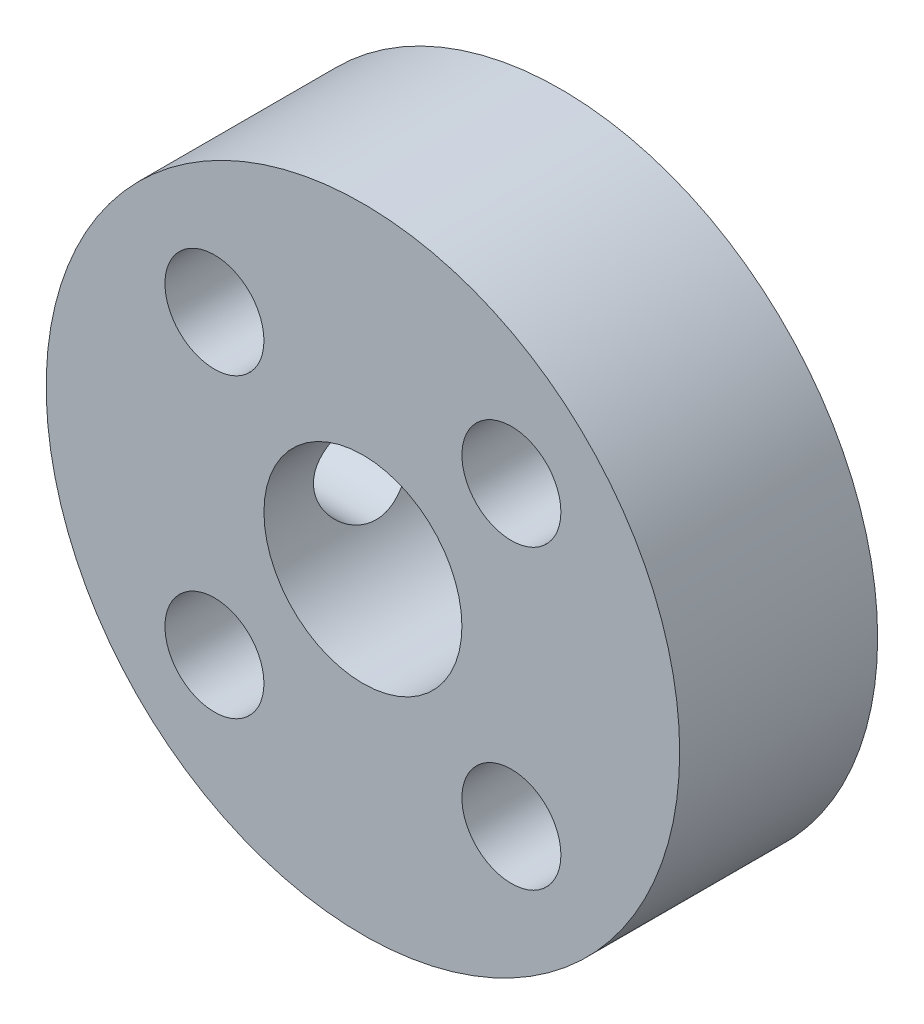
ISO-10303-21;
HEADER;
FILE_DESCRIPTION(('STEP AP214'),'2;1');
FILE_NAME('part.step','',(''),(''),'','','');
FILE_SCHEMA(('AUTOMOTIVE_DESIGN { 1 0 10303 214 1 1 1 1 }'));
ENDSEC;
DATA;
#1=APPLICATION_CONTEXT('core data for automotive mechanical design processes');
#2=APPLICATION_PROTOCOL_DEFINITION('international standard','automotive_design',2000,#1);
#3=PRODUCT_CONTEXT('',#1,'mechanical');
#4=PRODUCT('Part','Part','',(#3));
#5=PRODUCT_RELATED_PRODUCT_CATEGORY('part','',(#4));
#6=PRODUCT_DEFINITION_FORMATION('','',#4);
#7=PRODUCT_DEFINITION_CONTEXT('part definition',#1,'design');
#8=PRODUCT_DEFINITION('design','',#6,#7);
#9=PRODUCT_DEFINITION_SHAPE('','',#8);
#10=(LENGTH_UNIT() NAMED_UNIT(*) SI_UNIT(.MILLI.,.METRE.));
#11=(NAMED_UNIT(*) PLANE_ANGLE_UNIT() SI_UNIT($,.RADIAN.));
#12=(NAMED_UNIT(*) SI_UNIT($,.STERADIAN.) SOLID_ANGLE_UNIT());
#13=UNCERTAINTY_MEASURE_WITH_UNIT(LENGTH_MEASURE(1.E-05),#10,'distance_accuracy_value','');
#14=(GEOMETRIC_REPRESENTATION_CONTEXT(3) GLOBAL_UNCERTAINTY_ASSIGNED_CONTEXT((#13)) GLOBAL_UNIT_ASSIGNED_CONTEXT((#10,
#11,#12)) REPRESENTATION_CONTEXT('',''));
#15=CARTESIAN_POINT('',(0.,0.,0.));
#16=DIRECTION('',(0.,0.,1.));
#17=DIRECTION('',(1.,0.,0.));
#18=AXIS2_PLACEMENT_3D('',#15,#16,#17);
#19=CARTESIAN_POINT('',(0.,0.,12.7));
#20=DIRECTION('',(0.,0.,-1.));
#21=DIRECTION('',(-1.,0.,0.));
#22=AXIS2_PLACEMENT_3D('',#19,#20,#21);
#23=CYLINDRICAL_SURFACE('',#22,6.35);
#24=CARTESIAN_POINT('',(-6.35,0.,9.525));
#25=CARTESIAN_POINT('',(-6.34999931166444,-0.0834969220594998,9.52499911228237));
#26=CARTESIAN_POINT('',(-6.34834758911701,-0.167002655580042,9.52170012555405));
#27=CARTESIAN_POINT('',(-6.34179105821714,-0.333378330258781,9.50855412545011));
#28=CARTESIAN_POINT('',(-6.33688483467113,-0.416247978955771,9.49870426347423));
#29=CARTESIAN_POINT('',(-6.31742426748325,-0.663182030647009,9.45942793495399));
#30=CARTESIAN_POINT('',(-6.29812827299425,-0.825450146761554,9.4202749225986));
#31=CARTESIAN_POINT('',(-6.2489182313574,-1.13965128900426,9.31800928870585));
#32=CARTESIAN_POINT('',(-6.21904547786825,-1.29162180811868,9.25498978075659));
#33=CARTESIAN_POINT('',(-6.15142812041637,-1.58264035037879,9.1072639263711));
#34=CARTESIAN_POINT('',(-6.11368413715877,-1.72168939123018,9.02255928984904));
#35=CARTESIAN_POINT('',(-6.03111096182982,-1.99234108848171,8.82803037026578));
#36=CARTESIAN_POINT('',(-5.98599127270818,-2.12298433900091,8.71699642220607));
#37=CARTESIAN_POINT('',(-5.89470535591056,-2.36467069069853,8.47560331642721));
#38=CARTESIAN_POINT('',(-5.84853836069043,-2.47569885601321,8.34522957023356));
#39=CARTESIAN_POINT('',(-5.75623634934464,-2.68368848497886,8.05657905224669));
#40=CARTESIAN_POINT('',(-5.71038146176788,-2.77889135161934,7.89692246869841));
#41=CARTESIAN_POINT('',(-5.64919759286363,-2.90019349951534,7.64545201282557));
#42=CARTESIAN_POINT('',(-5.63006420805933,-2.93705266116892,7.55959993817132));
#43=CARTESIAN_POINT('',(-5.59504604853267,-3.00322508739606,7.38441438629358));
#44=CARTESIAN_POINT('',(-5.57915935583429,-3.03254280972159,7.29508300181945));
#45=CARTESIAN_POINT('',(-5.55212611635049,-3.08174263292982,7.11898944803526));
#46=CARTESIAN_POINT('',(-5.54075429137746,-3.10208128111978,7.03238920597143));
#47=CARTESIAN_POINT('',(-5.52193654886444,-3.13545600360765,6.8574127210056));
#48=CARTESIAN_POINT('',(-5.51448854851135,-3.14849595237257,6.7690374462283));
#49=CARTESIAN_POINT('',(-5.50383875782919,-3.1670771305344,6.59129326115138));
#50=CARTESIAN_POINT('',(-5.50063441026522,-3.1726228759965,6.5019249820126));
#51=CARTESIAN_POINT('',(-5.49859788398609,-3.17614778806993,6.32301921582192));
#52=CARTESIAN_POINT('',(-5.49976528812799,-3.17412767659872,6.23348174572866));
#53=CARTESIAN_POINT('',(-5.50899190362732,-3.1581193033026,5.98725212427559));
#54=CARTESIAN_POINT('',(-5.52160857357707,-3.13621253452965,5.83115827018664));
#55=CARTESIAN_POINT('',(-5.55866493052824,-3.07003746372168,5.52535335869347));
#56=CARTESIAN_POINT('',(-5.58310838358077,-3.02576203854504,5.37564435097724));
#57=CARTESIAN_POINT('',(-5.64157885407236,-2.91531509833647,5.08245570343586));
#58=CARTESIAN_POINT('',(-5.67581583876129,-2.84865758129418,4.93920239006338));
#59=CARTESIAN_POINT('',(-5.75003268807633,-2.69570761526054,4.66523391382598));
#60=CARTESIAN_POINT('',(-5.79001512927804,-2.60940634674629,4.53452442039149));
#61=CARTESIAN_POINT('',(-5.87734289018611,-2.40685964249565,4.27189572574971));
#62=CARTESIAN_POINT('',(-5.92497898403936,-2.28820488335253,4.14192461514349));
#63=CARTESIAN_POINT('',(-6.01813700574905,-2.03058898448427,3.90291485713616));
#64=CARTESIAN_POINT('',(-6.06365791538158,-1.89161819563546,3.7938862136413));
#65=CARTESIAN_POINT('',(-6.1500381059768,-1.58913989972483,3.59509808028028));
#66=CARTESIAN_POINT('',(-6.19058274974572,-1.42479265164789,3.50646851442006));
#67=CARTESIAN_POINT('',(-6.25976272299952,-1.08098023585583,3.35884191836465));
#68=CARTESIAN_POINT('',(-6.28840750578946,-0.901527205073897,3.29982135886829));
#69=CARTESIAN_POINT('',(-6.32854759690358,-0.548533610626835,3.21794059660095));
#70=CARTESIAN_POINT('',(-6.34126679122995,-0.375734359385246,3.19249032741266));
#71=CARTESIAN_POINT('',(-6.35231817716325,-0.0278752299448331,3.17034947773974));
#72=CARTESIAN_POINT('',(-6.35065718436129,0.147183538060018,3.17364527286068));
#73=CARTESIAN_POINT('',(-6.33384535408399,0.480164686080361,3.20740623594539));
#74=CARTESIAN_POINT('',(-6.31975005060431,0.638363620564189,3.23574579147484));
#75=CARTESIAN_POINT('',(-6.28085393924121,0.947441883053,3.31545587820989));
#76=CARTESIAN_POINT('',(-6.25605195113515,1.09832040207141,3.36682894847728));
#77=CARTESIAN_POINT('',(-6.19709998236334,1.39347133182512,3.4924951309378));
#78=CARTESIAN_POINT('',(-6.16270299610718,1.53743151047822,3.56740158411119));
#79=CARTESIAN_POINT('',(-6.08787118465664,1.8112148234104,3.73731642568587));
#80=CARTESIAN_POINT('',(-6.0474337895468,1.94103189959927,3.8323333773854));
#81=CARTESIAN_POINT('',(-5.95973602709939,2.19636241342679,4.05053935037377));
#82=CARTESIAN_POINT('',(-5.91219559251098,2.3202013468198,4.17557860711157));
#83=CARTESIAN_POINT('',(-5.81858093231368,2.54589381918874,4.44476235514975));
#84=CARTESIAN_POINT('',(-5.77250773963547,2.6477321493525,4.58891995238093));
#85=CARTESIAN_POINT('',(-5.68487535288742,2.83117262876716,4.90106860195835));
#86=CARTESIAN_POINT('',(-5.64364281441821,2.91155594998014,5.06987576951038));
#87=CARTESIAN_POINT('',(-5.5744767953732,3.04191297152938,5.42134446488967));
#88=CARTESIAN_POINT('',(-5.54652618900869,3.0919258549222,5.60398779784738));
#89=CARTESIAN_POINT('',(-5.51057765714603,3.15551086037918,5.95918995647016));
#90=CARTESIAN_POINT('',(-5.50092192343245,3.17212027309711,6.13103375040721));
#91=CARTESIAN_POINT('',(-5.49800001145358,3.17718805563876,6.4752444424952));
#92=CARTESIAN_POINT('',(-5.5047267290444,3.16565862768386,6.64761108154264));
#93=CARTESIAN_POINT('',(-5.53205211477784,3.11761548073658,6.97066010307391));
#94=CARTESIAN_POINT('',(-5.55126823076269,3.08358651207686,7.12184394173115));
#95=CARTESIAN_POINT('',(-5.59977978302582,2.99458164828807,7.41619083016717));
#96=CARTESIAN_POINT('',(-5.62907846127335,2.93959901505999,7.5593512828503));
#97=CARTESIAN_POINT('',(-5.69685576337174,2.8061154442137,7.84423369942855));
#98=CARTESIAN_POINT('',(-5.73581889480533,2.72628260503929,7.98521280936567));
#99=CARTESIAN_POINT('',(-5.81772207082382,2.54682759156583,8.2526974317231));
#100=CARTESIAN_POINT('',(-5.8606641782013,2.44719512169931,8.3791953599427));
#101=CARTESIAN_POINT('',(-5.95192753761203,2.21680287661219,8.63009752417706));
#102=CARTESIAN_POINT('',(-6.00026839877346,2.08373188558713,8.75237975641279));
#103=CARTESIAN_POINT('',(-6.0921234557675,1.79751265125244,8.97339787323311));
#104=CARTESIAN_POINT('',(-6.13563504323042,1.64435365457428,9.07212106598272));
#105=CARTESIAN_POINT('',(-6.19391073190243,1.40178715704487,9.20028026619707));
#106=CARTESIAN_POINT('',(-6.21223173271383,1.31842200030919,9.23980058368139));
#107=CARTESIAN_POINT('',(-6.24595363475604,1.14807701021671,9.31159947482369));
#108=CARTESIAN_POINT('',(-6.26135597012704,1.06109897786306,9.34388160653437));
#109=CARTESIAN_POINT('',(-6.28875097111981,0.884361322813108,9.400759345915));
#110=CARTESIAN_POINT('',(-6.30075106809478,0.794608244970572,9.42537171813811));
#111=CARTESIAN_POINT('',(-6.32100983571903,0.612925661591583,9.46666738952989));
#112=CARTESIAN_POINT('',(-6.3292707916836,0.520997521680291,9.48335553219354));
#113=CARTESIAN_POINT('',(-6.34032503263334,0.357531347524376,9.50561628486239));
#114=CARTESIAN_POINT('',(-6.34394670812889,0.286274046488597,9.51287882124963));
#115=CARTESIAN_POINT('',(-6.34878452045567,0.143346668941347,9.52257112653757));
#116=CARTESIAN_POINT('',(-6.35000059089052,0.0716765810914259,9.52500076204683));
#117=CARTESIAN_POINT('',(-6.35,0.,9.525));
#118=B_SPLINE_CURVE_WITH_KNOTS('',3,(#24,#25,#26,#27,#28,#29,#30,#31,#32,#33,#34,#35,#36,#37,
#38,#39,#40,#41,#42,#43,#44,#45,#46,#47,#48,#49,#50,#51,#52,#53,#54,#55,#56,#57,#58,#59,#60,#61,
#62,#63,#64,#65,#66,#67,#68,#69,#70,#71,#72,#73,#74,#75,#76,#77,#78,#79,#80,#81,#82,#83,#84,#85,
#86,#87,#88,#89,#90,#91,#92,#93,#94,#95,#96,#97,#98,#99,#100,#101,#102,#103,#104,#105,#106,#107,
#108,#109,#110,#111,#112,#113,#114,#115,#116,#117),.UNSPECIFIED.,.T.,.F.,(4,2,2,2,2,2,2,2,2,2,2,
2,2,2,2,2,2,2,2,2,2,2,2,2,2,2,2,2,2,2,2,2,2,2,2,2,2,2,2,2,2,2,2,2,2,2,4),(0.,0.25041561210268,
0.500940186864014,1.00234854488129,1.50182051324263,2.00125310940106,2.53090025348452,
3.06094897410615,3.63210298373098,3.91787290005989,4.20347350732849,4.47213270490102,
4.74064915090148,5.00900371453887,5.27733267302576,5.74927594687738,6.22136960256846,
6.70445970327764,7.18776712794021,7.7323564652788,8.27720530143645,8.84735553323665,
9.41705196489304,9.93956405039339,10.4618285011675,10.9436138594975,11.4254523397102,
11.9210677568139,12.4168946391879,12.9614122158798,13.5063050164601,14.0775857365549,
14.6481278321882,15.1639000911419,15.6794487286237,16.1458838633213,16.6124691169503,
17.1104020806943,17.6085946442304,18.1673210354482,18.7263477502426,19.0082017078365,
19.2899168101042,19.5710117490933,19.8519346536844,20.0668939492148,20.2818591776892),.UNSPECIFIED.);
#119=CARTESIAN_POINT('',(-6.35,0.,9.525));
#120=VERTEX_POINT('',#119);
#121=EDGE_CURVE('E58',#120,#120,#118,.T.);
#122=ORIENTED_EDGE('',*,*,#121,.F.);
#123=EDGE_LOOP('',(#122));
#124=FACE_BOUND('',#123,.T.);
#125=CARTESIAN_POINT('',(0.,0.,12.7));
#126=DIRECTION('',(0.,0.,1.));
#127=DIRECTION('',(1.,0.,0.));
#128=AXIS2_PLACEMENT_3D('',#125,#126,#127);
#129=CIRCLE('',#128,6.35);
#130=CARTESIAN_POINT('',(6.35,0.,12.7));
#131=VERTEX_POINT('',#130);
#132=EDGE_CURVE('E45',#131,#131,#129,.T.);
#133=ORIENTED_EDGE('',*,*,#132,.T.);
#134=EDGE_LOOP('',(#133));
#135=FACE_BOUND('',#134,.T.);
#136=CARTESIAN_POINT('',(0.,0.,0.));
#137=DIRECTION('',(0.,0.,1.));
#138=DIRECTION('',(1.,0.,0.));
#139=AXIS2_PLACEMENT_3D('',#136,#137,#138);
#140=CIRCLE('',#139,6.35);
#141=CARTESIAN_POINT('',(6.35,0.,0.));
#142=VERTEX_POINT('',#141);
#143=EDGE_CURVE('E67',#142,#142,#140,.T.);
#144=ORIENTED_EDGE('',*,*,#143,.F.);
#145=EDGE_LOOP('',(#144));
#146=FACE_BOUND('',#145,.T.);
#147=ADVANCED_FACE('F30',(#124,#135,#146),#23,.F.);
#148=CARTESIAN_POINT('',(-9.525,9.525,12.7));
#149=DIRECTION('',(0.,0.,-1.));
#150=DIRECTION('',(-1.,0.,0.));
#151=AXIS2_PLACEMENT_3D('',#148,#149,#150);
#152=CYLINDRICAL_SURFACE('',#151,3.175);
#153=CARTESIAN_POINT('',(-9.525,9.525,12.7));
#154=DIRECTION('',(0.,0.,1.));
#155=DIRECTION('',(1.,0.,0.));
#156=AXIS2_PLACEMENT_3D('',#153,#154,#155);
#157=CIRCLE('',#156,3.175);
#158=CARTESIAN_POINT('',(-6.35,9.525,12.7));
#159=VERTEX_POINT('',#158);
#160=EDGE_CURVE('E50',#159,#159,#157,.T.);
#161=ORIENTED_EDGE('',*,*,#160,.T.);
#162=EDGE_LOOP('',(#161));
#163=FACE_BOUND('',#162,.T.);
#164=CARTESIAN_POINT('',(-9.525,9.525,0.));
#165=DIRECTION('',(0.,0.,1.));
#166=DIRECTION('',(1.,0.,0.));
#167=AXIS2_PLACEMENT_3D('',#164,#165,#166);
#168=CIRCLE('',#167,3.175);
#169=CARTESIAN_POINT('',(-6.35,9.525,0.));
#170=VERTEX_POINT('',#169);
#171=EDGE_CURVE('E64',#170,#170,#168,.T.);
#172=ORIENTED_EDGE('',*,*,#171,.F.);
#173=EDGE_LOOP('',(#172));
#174=FACE_BOUND('',#173,.T.);
#175=ADVANCED_FACE('F91',(#163,#174),#152,.F.);
#176=CARTESIAN_POINT('',(9.525,9.52500000000001,12.7));
#177=DIRECTION('',(0.,0.,-1.));
#178=DIRECTION('',(-1.,0.,0.));
#179=AXIS2_PLACEMENT_3D('',#176,#177,#178);
#180=CYLINDRICAL_SURFACE('',#179,3.175);
#181=CARTESIAN_POINT('',(9.525,9.52500000000001,12.7));
#182=DIRECTION('',(0.,0.,1.));
#183=DIRECTION('',(1.,0.,0.));
#184=AXIS2_PLACEMENT_3D('',#181,#182,#183);
#185=CIRCLE('',#184,3.175);
#186=CARTESIAN_POINT('',(12.7,9.52500000000001,12.7));
#187=VERTEX_POINT('',#186);
#188=EDGE_CURVE('E80',#187,#187,#185,.T.);
#189=ORIENTED_EDGE('',*,*,#188,.T.);
#190=EDGE_LOOP('',(#189));
#191=FACE_BOUND('',#190,.T.);
#192=CARTESIAN_POINT('',(9.525,9.52500000000001,0.));
#193=DIRECTION('',(0.,0.,1.));
#194=DIRECTION('',(1.,0.,0.));
#195=AXIS2_PLACEMENT_3D('',#192,#193,#194);
#196=CIRCLE('',#195,3.175);
#197=CARTESIAN_POINT('',(12.7,9.52500000000001,0.));
#198=VERTEX_POINT('',#197);
#199=EDGE_CURVE('E61',#198,#198,#196,.T.);
#200=ORIENTED_EDGE('',*,*,#199,.F.);
#201=EDGE_LOOP('',(#200));
#202=FACE_BOUND('',#201,.T.);
#203=ADVANCED_FACE('F124',(#191,#202),#180,.F.);
#204=CARTESIAN_POINT('',(9.525,-9.525,12.7));
#205=DIRECTION('',(0.,0.,-1.));
#206=DIRECTION('',(-1.,0.,0.));
#207=AXIS2_PLACEMENT_3D('',#204,#205,#206);
#208=CYLINDRICAL_SURFACE('',#207,3.175);
#209=CARTESIAN_POINT('',(9.525,-9.525,12.7));
#210=DIRECTION('',(0.,0.,1.));
#211=DIRECTION('',(1.,0.,0.));
#212=AXIS2_PLACEMENT_3D('',#209,#210,#211);
#213=CIRCLE('',#212,3.175);
#214=CARTESIAN_POINT('',(12.7,-9.525,12.7));
#215=VERTEX_POINT('',#214);
#216=EDGE_CURVE('E75',#215,#215,#213,.T.);
#217=ORIENTED_EDGE('',*,*,#216,.T.);
#218=EDGE_LOOP('',(#217));
#219=FACE_BOUND('',#218,.T.);
#220=CARTESIAN_POINT('',(9.525,-9.525,0.));
#221=DIRECTION('',(0.,0.,1.));
#222=DIRECTION('',(1.,0.,0.));
#223=AXIS2_PLACEMENT_3D('',#220,#221,#222);
#224=CIRCLE('',#223,3.175);
#225=CARTESIAN_POINT('',(12.7,-9.525,0.));
#226=VERTEX_POINT('',#225);
#227=EDGE_CURVE('E57',#226,#226,#224,.T.);
#228=ORIENTED_EDGE('',*,*,#227,.F.);
#229=EDGE_LOOP('',(#228));
#230=FACE_BOUND('',#229,.T.);
#231=ADVANCED_FACE('F126',(#219,#230),#208,.F.);
#232=CARTESIAN_POINT('',(-9.525,-9.525,12.7));
#233=DIRECTION('',(0.,0.,-1.));
#234=DIRECTION('',(-1.,0.,0.));
#235=AXIS2_PLACEMENT_3D('',#232,#233,#234);
#236=CYLINDRICAL_SURFACE('',#235,3.175);
#237=CARTESIAN_POINT('',(-9.525,-9.525,12.7));
#238=DIRECTION('',(0.,0.,1.));
#239=DIRECTION('',(1.,0.,0.));
#240=AXIS2_PLACEMENT_3D('',#237,#238,#239);
#241=CIRCLE('',#240,3.175);
#242=CARTESIAN_POINT('',(-6.35,-9.525,12.7));
#243=VERTEX_POINT('',#242);
#244=EDGE_CURVE('E71',#243,#243,#241,.T.);
#245=ORIENTED_EDGE('',*,*,#244,.T.);
#246=EDGE_LOOP('',(#245));
#247=FACE_BOUND('',#246,.T.);
#248=CARTESIAN_POINT('',(-9.525,-9.525,0.));
#249=DIRECTION('',(0.,0.,1.));
#250=DIRECTION('',(1.,0.,0.));
#251=AXIS2_PLACEMENT_3D('',#248,#249,#250);
#252=CIRCLE('',#251,3.175);
#253=CARTESIAN_POINT('',(-6.35,-9.525,0.));
#254=VERTEX_POINT('',#253);
#255=EDGE_CURVE('E54',#254,#254,#252,.T.);
#256=ORIENTED_EDGE('',*,*,#255,.F.);
#257=EDGE_LOOP('',(#256));
#258=FACE_BOUND('',#257,.T.);
#259=ADVANCED_FACE('F32',(#247,#258),#236,.F.);
#260=CARTESIAN_POINT('',(0.,0.,12.7));
#261=DIRECTION('',(0.,0.,-1.));
#262=DIRECTION('',(-1.,0.,0.));
#263=AXIS2_PLACEMENT_3D('',#260,#261,#262);
#264=CYLINDRICAL_SURFACE('',#263,20.32);
#265=CARTESIAN_POINT('',(-20.32,0.,3.175));
#266=CARTESIAN_POINT('',(-20.3199970814699,0.177184173534212,3.17500723680483));
#267=CARTESIAN_POINT('',(-20.3176582785689,0.354468944179444,3.18988200449242));
#268=CARTESIAN_POINT('',(-20.3085534658394,0.704076970022189,3.24896948792148));
#269=CARTESIAN_POINT('',(-20.301783232328,0.876395327880612,3.29321019347946));
#270=CARTESIAN_POINT('',(-20.2845758540054,1.2109609233202,3.4096701717644));
#271=CARTESIAN_POINT('',(-20.2741415644523,1.37321588740818,3.48186766332923));
#272=CARTESIAN_POINT('',(-20.2507569842846,1.68328498882664,3.65213715232984));
#273=CARTESIAN_POINT('',(-20.2378070206544,1.83110099916775,3.75020578765565));
#274=CARTESIAN_POINT('',(-20.2107072088623,2.10936828779755,3.97031597140953));
#275=CARTESIAN_POINT('',(-20.1965490326827,2.23967989851116,4.09253308351062));
#276=CARTESIAN_POINT('',(-20.1686931668546,2.47803376404985,4.35709307430149));
#277=CARTESIAN_POINT('',(-20.1549955046445,2.58607469390824,4.49943714957125));
#278=CARTESIAN_POINT('',(-20.1295308372186,2.77736991297682,4.80115660460653));
#279=CARTESIAN_POINT('',(-20.1177745952835,2.86048797418649,4.96061934259948));
#280=CARTESIAN_POINT('',(-20.097638262128,2.99870725628273,5.29145679178941));
#281=CARTESIAN_POINT('',(-20.0892579710381,3.0538101358278,5.46283079708841));
#282=CARTESIAN_POINT('',(-20.0769046582902,3.13399880339152,5.81115284445261));
#283=CARTESIAN_POINT('',(-20.072896436961,3.15932445969119,5.98804439398987));
#284=CARTESIAN_POINT('',(-20.0696343726115,3.17998309592179,6.34360832989366));
#285=CARTESIAN_POINT('',(-20.0703802336579,3.17531794272792,6.52228060472187));
#286=CARTESIAN_POINT('',(-20.0765098907811,3.1363231762729,6.87463323045291));
#287=CARTESIAN_POINT('',(-20.0818517867488,3.1022615495881,7.0483440736585));
#288=CARTESIAN_POINT('',(-20.0965061155875,3.00586061048864,7.38755444807634));
#289=CARTESIAN_POINT('',(-20.1058186694914,2.94352043608848,7.55305372881348));
#290=CARTESIAN_POINT('',(-20.1274109370537,2.79205584525718,7.87195366509999));
#291=CARTESIAN_POINT('',(-20.139703092208,2.70281872840747,8.02529991555179));
#292=CARTESIAN_POINT('',(-20.1658606861062,2.50017353846229,8.31494341032063));
#293=CARTESIAN_POINT('',(-20.1797262367103,2.38676374631331,8.45123944100708));
#294=CARTESIAN_POINT('',(-20.207653085361,2.13752542804363,8.70446601322431));
#295=CARTESIAN_POINT('',(-20.221714873172,2.00146666711885,8.82117001100221));
#296=CARTESIAN_POINT('',(-20.2483100919174,1.71157512317179,9.03012309496267));
#297=CARTESIAN_POINT('',(-20.2608435150877,1.55774224986527,9.12237205691717));
#298=CARTESIAN_POINT('',(-20.2829845676434,1.23646682736174,9.27981135324644));
#299=CARTESIAN_POINT('',(-20.2925902064826,1.06901511652538,9.34498328933691));
#300=CARTESIAN_POINT('',(-20.3077770120086,0.725359909064884,9.44621677865798));
#301=CARTESIAN_POINT('',(-20.313358474154,0.549157055972744,9.48228046906443));
#302=CARTESIAN_POINT('',(-20.3198286989364,0.194955587689944,9.52397038109174));
#303=CARTESIAN_POINT('',(-20.3207654517693,0.016994456116052,9.52990788829975));
#304=CARTESIAN_POINT('',(-20.3179716384391,-0.337381273942785,9.51200446422331));
#305=CARTESIAN_POINT('',(-20.3142412294455,-0.513795924304948,9.48816453571183));
#306=CARTESIAN_POINT('',(-20.3025619309039,-0.859121276757445,9.41164184764617));
#307=CARTESIAN_POINT('',(-20.2946353595354,-1.02806660281117,9.35911163699998));
#308=CARTESIAN_POINT('',(-20.2754493611812,-1.35475226617791,9.22686103011354));
#309=CARTESIAN_POINT('',(-20.2641897663079,-1.51249203856005,9.14713926417781));
#310=CARTESIAN_POINT('',(-20.23946895381,-1.81365169685802,8.96204457126925));
#311=CARTESIAN_POINT('',(-20.2259911540254,-1.95694950720533,8.85647527648509));
#312=CARTESIAN_POINT('',(-20.1983832818983,-2.22390584564914,8.62295445089711));
#313=CARTESIAN_POINT('',(-20.184253168277,-2.34756312867713,8.49500150220984));
#314=CARTESIAN_POINT('',(-20.1567799497154,-2.57286862586397,8.21895587953414));
#315=CARTESIAN_POINT('',(-20.1434451231232,-2.6743075620184,8.07069144415464));
#316=CARTESIAN_POINT('',(-20.119221798634,-2.85083971012833,7.7590445864501));
#317=CARTESIAN_POINT('',(-20.1083332303194,-2.92593368048193,7.59566259948837));
#318=CARTESIAN_POINT('',(-20.0902960061749,-3.04732400370143,7.25902835629298));
#319=CARTESIAN_POINT('',(-20.0831333458318,-3.09372831783848,7.08581581466766));
#320=CARTESIAN_POINT('',(-20.0733224425661,-3.1567643499148,6.73393478754674));
#321=CARTESIAN_POINT('',(-20.0706738588824,-3.17339831517946,6.55526671491786));
#322=CARTESIAN_POINT('',(-20.07020443717,-3.1763646491726,6.19963363079751));
#323=CARTESIAN_POINT('',(-20.0723311537449,-3.163026192965,6.02267134689445));
#324=CARTESIAN_POINT('',(-20.0810583765612,-3.10713403534994,5.67354047262676));
#325=CARTESIAN_POINT('',(-20.0876588731154,-3.06458039720441,5.50137187188282));
#326=CARTESIAN_POINT('',(-20.1045710284573,-2.95158578962651,5.16681996016654));
#327=CARTESIAN_POINT('',(-20.1148793657083,-2.88116977407998,5.00442804261182));
#328=CARTESIAN_POINT('',(-20.1380494374019,-2.7144823605395,4.69370967063113));
#329=CARTESIAN_POINT('',(-20.1509112730375,-2.61820993782525,4.54538377397369));
#330=CARTESIAN_POINT('',(-20.1779069147717,-2.40135420336631,4.26533875895892));
#331=CARTESIAN_POINT('',(-20.1920525947357,-2.28052766010356,4.13380911030043));
#332=CARTESIAN_POINT('',(-20.2199245542373,-2.01850745190519,3.89277702978885));
#333=CARTESIAN_POINT('',(-20.2336507358196,-1.87730907339609,3.78327970978832));
#334=CARTESIAN_POINT('',(-20.2592318012001,-1.57755191073114,3.58882794674992));
#335=CARTESIAN_POINT('',(-20.2710749572644,-1.41889400262082,3.50402477659529));
#336=CARTESIAN_POINT('',(-20.2914409999538,-1.08947189059439,3.36239993483496));
#337=CARTESIAN_POINT('',(-20.2999672758049,-0.918720256258838,3.30554968485084));
#338=CARTESIAN_POINT('',(-20.310823562484,-0.622699084687725,3.23414006321496));
#339=CARTESIAN_POINT('',(-20.3142467936517,-0.499244081077564,3.21199701690117));
#340=CARTESIAN_POINT('',(-20.3188360284598,-0.25054280327024,3.18242453000857));
#341=CARTESIAN_POINT('',(-20.3200020638511,-0.125296554294781,3.17499488246218));
#342=CARTESIAN_POINT('',(-20.32,0.,3.175));
#343=B_SPLINE_CURVE_WITH_KNOTS('',3,(#265,#266,#267,#268,#269,#270,#271,#272,#273,#274,#275,
#276,#277,#278,#279,#280,#281,#282,#283,#284,#285,#286,#287,#288,#289,#290,#291,#292,#293,#294,
#295,#296,#297,#298,#299,#300,#301,#302,#303,#304,#305,#306,#307,#308,#309,#310,#311,#312,#313,
#314,#315,#316,#317,#318,#319,#320,#321,#322,#323,#324,#325,#326,#327,#328,#329,#330,#331,#332,
#333,#334,#335,#336,#337,#338,#339,#340,#341,#342),.UNSPECIFIED.,.T.,.F.,(4,2,2,2,2,2,2,2,2,2,2,
2,2,2,2,2,2,2,2,2,2,2,2,2,2,2,2,2,2,2,2,2,2,2,2,2,2,2,4),(0.,0.531094620406413,1.06269617601058,
1.5938843908901,2.12500360865878,2.66013651553293,3.19530125029685,3.73333998829314,
4.27134686761733,4.80498951541443,5.33859894521592,5.86739461548677,6.39620640556834,
6.92726551300981,7.45836239962927,7.99523080064646,8.5321019288256,9.06933725568297,
9.6065331342393,10.1381668458751,10.6697826549101,11.1985989484084,11.7274418834238,
12.2604344766648,12.793460844338,13.3313103991698,13.8691444695421,14.4049421120182,
14.9406993061121,15.4706012863034,16.00050211906,16.5299294364761,17.0593777388261,
17.5943515564074,18.1294493537072,18.667759263338,19.2055176678348,19.5810888076645,
19.9566546644456),.UNSPECIFIED.);
#344=CARTESIAN_POINT('',(-20.32,0.,3.175));
#345=VERTEX_POINT('',#344);
#346=EDGE_CURVE('E10',#345,#345,#343,.T.);
#347=ORIENTED_EDGE('',*,*,#346,.T.);
#348=EDGE_LOOP('',(#347));
#349=FACE_BOUND('',#348,.T.);
#350=CARTESIAN_POINT('',(0.,0.,12.7));
#351=DIRECTION('',(0.,0.,1.));
#352=DIRECTION('',(1.,0.,0.));
#353=AXIS2_PLACEMENT_3D('',#350,#351,#352);
#354=CIRCLE('',#353,20.32);
#355=CARTESIAN_POINT('',(20.32,0.,12.7));
#356=VERTEX_POINT('',#355);
#357=EDGE_CURVE('E41',#356,#356,#354,.T.);
#358=ORIENTED_EDGE('',*,*,#357,.F.);
#359=EDGE_LOOP('',(#358));
#360=FACE_BOUND('',#359,.T.);
#361=CARTESIAN_POINT('',(0.,0.,0.));
#362=DIRECTION('',(0.,0.,1.));
#363=DIRECTION('',(1.,0.,0.));
#364=AXIS2_PLACEMENT_3D('',#361,#362,#363);
#365=CIRCLE('',#364,20.32);
#366=CARTESIAN_POINT('',(20.32,0.,0.));
#367=VERTEX_POINT('',#366);
#368=EDGE_CURVE('E69',#367,#367,#365,.T.);
#369=ORIENTED_EDGE('',*,*,#368,.T.);
#370=EDGE_LOOP('',(#369));
#371=FACE_BOUND('',#370,.T.);
#372=ADVANCED_FACE('F98',(#349,#360,#371),#264,.T.);
#373=CARTESIAN_POINT('',(0.,0.,12.7));
#374=DIRECTION('',(0.,0.,1.));
#375=DIRECTION('',(1.,0.,0.));
#376=AXIS2_PLACEMENT_3D('',#373,#374,#375);
#377=PLANE('',#376);
#378=ORIENTED_EDGE('',*,*,#244,.F.);
#379=EDGE_LOOP('',(#378));
#380=FACE_BOUND('',#379,.T.);
#381=ORIENTED_EDGE('',*,*,#216,.F.);
#382=EDGE_LOOP('',(#381));
#383=FACE_BOUND('',#382,.T.);
#384=ORIENTED_EDGE('',*,*,#188,.F.);
#385=EDGE_LOOP('',(#384));
#386=FACE_BOUND('',#385,.T.);
#387=ORIENTED_EDGE('',*,*,#160,.F.);
#388=EDGE_LOOP('',(#387));
#389=FACE_BOUND('',#388,.T.);
#390=ORIENTED_EDGE('',*,*,#132,.F.);
#391=EDGE_LOOP('',(#390));
#392=FACE_BOUND('',#391,.T.);
#393=ORIENTED_EDGE('',*,*,#357,.T.);
#394=EDGE_LOOP('',(#393));
#395=FACE_BOUND('',#394,.T.);
#396=ADVANCED_FACE('F94',(#380,#383,#386,#389,#392,#395),#377,.T.);
#397=CARTESIAN_POINT('',(0.,0.,0.));
#398=DIRECTION('',(0.,0.,1.));
#399=DIRECTION('',(1.,0.,0.));
#400=AXIS2_PLACEMENT_3D('',#397,#398,#399);
#401=PLANE('',#400);
#402=ORIENTED_EDGE('',*,*,#255,.T.);
#403=EDGE_LOOP('',(#402));
#404=FACE_BOUND('',#403,.T.);
#405=ORIENTED_EDGE('',*,*,#227,.T.);
#406=EDGE_LOOP('',(#405));
#407=FACE_BOUND('',#406,.T.);
#408=ORIENTED_EDGE('',*,*,#199,.T.);
#409=EDGE_LOOP('',(#408));
#410=FACE_BOUND('',#409,.T.);
#411=ORIENTED_EDGE('',*,*,#171,.T.);
#412=EDGE_LOOP('',(#411));
#413=FACE_BOUND('',#412,.T.);
#414=ORIENTED_EDGE('',*,*,#143,.T.);
#415=EDGE_LOOP('',(#414));
#416=FACE_BOUND('',#415,.T.);
#417=ORIENTED_EDGE('',*,*,#368,.F.);
#418=EDGE_LOOP('',(#417));
#419=FACE_BOUND('',#418,.T.);
#420=ADVANCED_FACE('F97',(#404,#407,#410,#413,#416,#419),#401,.F.);
#421=CARTESIAN_POINT('',(-20.32,0.,6.35));
#422=DIRECTION('',(1.,0.,0.));
#423=DIRECTION('',(0.,0.,-1.));
#424=AXIS2_PLACEMENT_3D('',#421,#422,#423);
#425=CYLINDRICAL_SURFACE('',#424,3.175);
#426=ORIENTED_EDGE('',*,*,#121,.T.);
#427=EDGE_LOOP('',(#426));
#428=FACE_BOUND('',#427,.T.);
#429=ORIENTED_EDGE('',*,*,#346,.F.);
#430=EDGE_LOOP('',(#429));
#431=FACE_BOUND('',#430,.T.);
#432=ADVANCED_FACE('F110',(#428,#431),#425,.F.);
#433=CLOSED_SHELL('',(#147,#175,#203,#231,#259,#372,#396,#420,#432));
#434=MANIFOLD_SOLID_BREP('B2',#433);
#435=ADVANCED_BREP_SHAPE_REPRESENTATION('',(#18,#434),#14);
#436=SHAPE_DEFINITION_REPRESENTATION(#9,#435);
ENDSEC;
END-ISO-10303-21;
